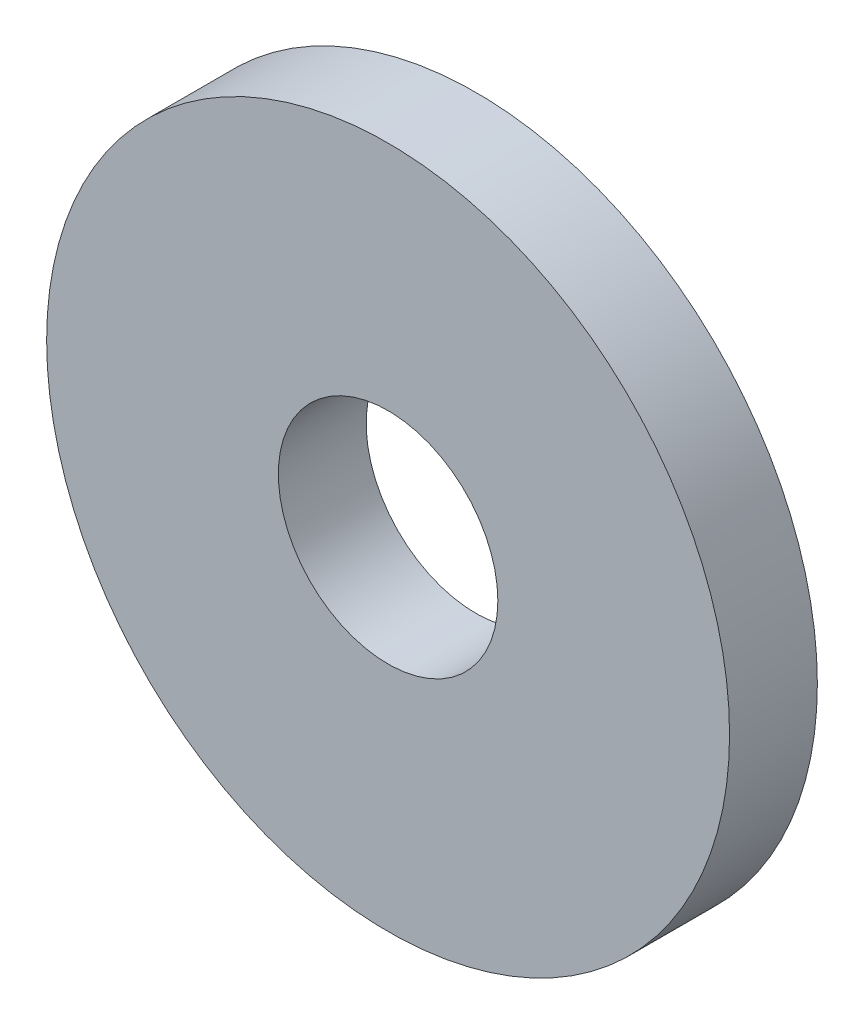
ISO-10303-21;
HEADER;
FILE_DESCRIPTION(('STEP AP214'),'2;1');
FILE_NAME('part.step','',(''),(''),'','','');
FILE_SCHEMA(('AUTOMOTIVE_DESIGN { 1 0 10303 214 1 1 1 1 }'));
ENDSEC;
DATA;
#1=APPLICATION_CONTEXT('core data for automotive mechanical design processes');
#2=APPLICATION_PROTOCOL_DEFINITION('international standard','automotive_design',2000,#1);
#3=PRODUCT_CONTEXT('',#1,'mechanical');
#4=PRODUCT('Part','Part','',(#3));
#5=PRODUCT_RELATED_PRODUCT_CATEGORY('part','',(#4));
#6=PRODUCT_DEFINITION_FORMATION('','',#4);
#7=PRODUCT_DEFINITION_CONTEXT('part definition',#1,'design');
#8=PRODUCT_DEFINITION('design','',#6,#7);
#9=PRODUCT_DEFINITION_SHAPE('','',#8);
#10=(LENGTH_UNIT() NAMED_UNIT(*) SI_UNIT(.MILLI.,.METRE.));
#11=(NAMED_UNIT(*) PLANE_ANGLE_UNIT() SI_UNIT($,.RADIAN.));
#12=(NAMED_UNIT(*) SI_UNIT($,.STERADIAN.) SOLID_ANGLE_UNIT());
#13=UNCERTAINTY_MEASURE_WITH_UNIT(LENGTH_MEASURE(1.E-05),#10,'distance_accuracy_value','');
#14=(GEOMETRIC_REPRESENTATION_CONTEXT(3) GLOBAL_UNCERTAINTY_ASSIGNED_CONTEXT((#13)) GLOBAL_UNIT_ASSIGNED_CONTEXT((#10,
#11,#12)) REPRESENTATION_CONTEXT('',''));
#15=CARTESIAN_POINT('',(0.,0.,0.));
#16=DIRECTION('',(0.,0.,1.));
#17=DIRECTION('',(1.,0.,0.));
#18=AXIS2_PLACEMENT_3D('',#15,#16,#17);
#19=CARTESIAN_POINT('',(0.,0.,3.6));
#20=DIRECTION('',(0.,0.,1.));
#21=DIRECTION('',(1.,0.,0.));
#22=AXIS2_PLACEMENT_3D('',#19,#20,#21);
#23=PLANE('',#22);
#24=CARTESIAN_POINT('',(0.,0.,3.6));
#25=DIRECTION('',(0.,0.,1.));
#26=DIRECTION('',(1.,0.,0.));
#27=AXIS2_PLACEMENT_3D('',#24,#25,#26);
#28=CIRCLE('',#27,14.);
#29=CARTESIAN_POINT('',(14.,0.,3.6));
#30=VERTEX_POINT('',#29);
#31=EDGE_CURVE('E10',#30,#30,#28,.T.);
#32=ORIENTED_EDGE('',*,*,#31,.T.);
#33=EDGE_LOOP('',(#32));
#34=FACE_BOUND('',#33,.T.);
#35=CARTESIAN_POINT('',(0.,0.,3.6));
#36=DIRECTION('',(0.,0.,1.));
#37=DIRECTION('',(1.,0.,0.));
#38=AXIS2_PLACEMENT_3D('',#35,#36,#37);
#39=CIRCLE('',#38,4.5);
#40=CARTESIAN_POINT('',(4.5,0.,3.6));
#41=VERTEX_POINT('',#40);
#42=EDGE_CURVE('E41',#41,#41,#39,.T.);
#43=ORIENTED_EDGE('',*,*,#42,.F.);
#44=EDGE_LOOP('',(#43));
#45=FACE_BOUND('',#44,.T.);
#46=ADVANCED_FACE('F30',(#34,#45),#23,.T.);
#47=CARTESIAN_POINT('',(0.,0.,0.));
#48=DIRECTION('',(0.,0.,1.));
#49=DIRECTION('',(1.,0.,0.));
#50=AXIS2_PLACEMENT_3D('',#47,#48,#49);
#51=PLANE('',#50);
#52=CARTESIAN_POINT('',(0.,0.,0.));
#53=DIRECTION('',(0.,0.,1.));
#54=DIRECTION('',(1.,0.,0.));
#55=AXIS2_PLACEMENT_3D('',#52,#53,#54);
#56=CIRCLE('',#55,14.);
#57=CARTESIAN_POINT('',(14.,0.,0.));
#58=VERTEX_POINT('',#57);
#59=EDGE_CURVE('E34',#58,#58,#56,.T.);
#60=ORIENTED_EDGE('',*,*,#59,.F.);
#61=EDGE_LOOP('',(#60));
#62=FACE_BOUND('',#61,.T.);
#63=CARTESIAN_POINT('',(0.,0.,0.));
#64=DIRECTION('',(0.,0.,1.));
#65=DIRECTION('',(1.,0.,0.));
#66=AXIS2_PLACEMENT_3D('',#63,#64,#65);
#67=CIRCLE('',#66,4.5);
#68=CARTESIAN_POINT('',(4.5,0.,0.));
#69=VERTEX_POINT('',#68);
#70=EDGE_CURVE('E43',#69,#69,#67,.T.);
#71=ORIENTED_EDGE('',*,*,#70,.T.);
#72=EDGE_LOOP('',(#71));
#73=FACE_BOUND('',#72,.T.);
#74=ADVANCED_FACE('F53',(#62,#73),#51,.F.);
#75=CARTESIAN_POINT('',(0.,0.,3.6));
#76=DIRECTION('',(0.,0.,-1.));
#77=DIRECTION('',(-1.,0.,0.));
#78=AXIS2_PLACEMENT_3D('',#75,#76,#77);
#79=CYLINDRICAL_SURFACE('',#78,14.);
#80=ORIENTED_EDGE('',*,*,#31,.F.);
#81=EDGE_LOOP('',(#80));
#82=FACE_BOUND('',#81,.T.);
#83=ORIENTED_EDGE('',*,*,#59,.T.);
#84=EDGE_LOOP('',(#83));
#85=FACE_BOUND('',#84,.T.);
#86=ADVANCED_FACE('F32',(#82,#85),#79,.T.);
#87=CARTESIAN_POINT('',(0.,0.,3.6));
#88=DIRECTION('',(0.,0.,-1.));
#89=DIRECTION('',(-1.,0.,0.));
#90=AXIS2_PLACEMENT_3D('',#87,#88,#89);
#91=CYLINDRICAL_SURFACE('',#90,4.5);
#92=ORIENTED_EDGE('',*,*,#42,.T.);
#93=EDGE_LOOP('',(#92));
#94=FACE_BOUND('',#93,.T.);
#95=ORIENTED_EDGE('',*,*,#70,.F.);
#96=EDGE_LOOP('',(#95));
#97=FACE_BOUND('',#96,.T.);
#98=ADVANCED_FACE('F49',(#94,#97),#91,.F.);
#99=CLOSED_SHELL('',(#46,#74,#86,#98));
#100=MANIFOLD_SOLID_BREP('B2',#99);
#101=ADVANCED_BREP_SHAPE_REPRESENTATION('',(#18,#100),#14);
#102=SHAPE_DEFINITION_REPRESENTATION(#9,#101);
ENDSEC;
END-ISO-10303-21;
